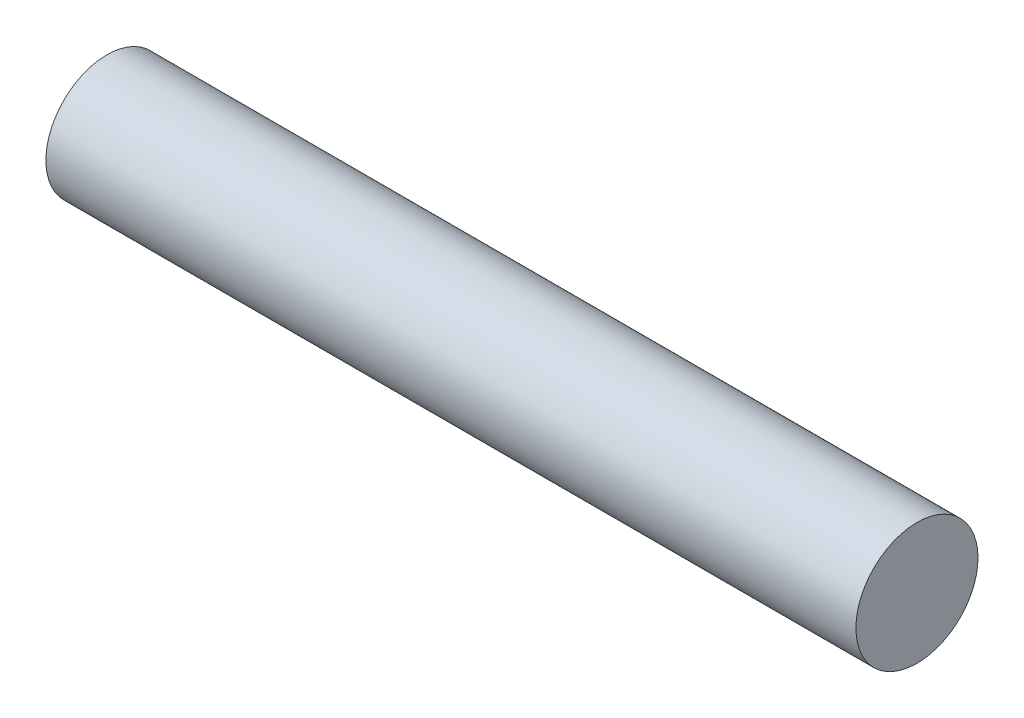
ISO-10303-21;
HEADER;
FILE_DESCRIPTION(('STEP AP214'),'2;1');
FILE_NAME('part.step','',(''),(''),'','','');
FILE_SCHEMA(('AUTOMOTIVE_DESIGN { 1 0 10303 214 1 1 1 1 }'));
ENDSEC;
DATA;
#1=APPLICATION_CONTEXT('core data for automotive mechanical design processes');
#2=APPLICATION_PROTOCOL_DEFINITION('international standard','automotive_design',2000,#1);
#3=PRODUCT_CONTEXT('',#1,'mechanical');
#4=PRODUCT('Part','Part','',(#3));
#5=PRODUCT_RELATED_PRODUCT_CATEGORY('part','',(#4));
#6=PRODUCT_DEFINITION_FORMATION('','',#4);
#7=PRODUCT_DEFINITION_CONTEXT('part definition',#1,'design');
#8=PRODUCT_DEFINITION('design','',#6,#7);
#9=PRODUCT_DEFINITION_SHAPE('','',#8);
#10=(LENGTH_UNIT() NAMED_UNIT(*) SI_UNIT(.MILLI.,.METRE.));
#11=(NAMED_UNIT(*) PLANE_ANGLE_UNIT() SI_UNIT($,.RADIAN.));
#12=(NAMED_UNIT(*) SI_UNIT($,.STERADIAN.) SOLID_ANGLE_UNIT());
#13=UNCERTAINTY_MEASURE_WITH_UNIT(LENGTH_MEASURE(1.E-05),#10,'distance_accuracy_value','');
#14=(GEOMETRIC_REPRESENTATION_CONTEXT(3) GLOBAL_UNCERTAINTY_ASSIGNED_CONTEXT((#13)) GLOBAL_UNIT_ASSIGNED_CONTEXT((#10,
#11,#12)) REPRESENTATION_CONTEXT('',''));
#15=CARTESIAN_POINT('',(0.,0.,0.));
#16=DIRECTION('',(0.,0.,1.));
#17=DIRECTION('',(1.,0.,0.));
#18=AXIS2_PLACEMENT_3D('',#15,#16,#17);
#19=CARTESIAN_POINT('',(92.9,0.,0.));
#20=DIRECTION('',(-1.,0.,0.));
#21=DIRECTION('',(0.,0.,1.));
#22=AXIS2_PLACEMENT_3D('',#19,#20,#21);
#23=CYLINDRICAL_SURFACE('',#22,7.);
#24=CARTESIAN_POINT('',(92.9,0.,0.));
#25=DIRECTION('',(1.,0.,0.));
#26=DIRECTION('',(0.,0.,-1.));
#27=AXIS2_PLACEMENT_3D('',#24,#25,#26);
#28=CIRCLE('',#27,7.);
#29=CARTESIAN_POINT('',(92.9,0.,-7.));
#30=VERTEX_POINT('',#29);
#31=EDGE_CURVE('E10',#30,#30,#28,.T.);
#32=ORIENTED_EDGE('',*,*,#31,.F.);
#33=EDGE_LOOP('',(#32));
#34=FACE_BOUND('',#33,.T.);
#35=CARTESIAN_POINT('',(0.,0.,0.));
#36=DIRECTION('',(1.,0.,0.));
#37=DIRECTION('',(0.,0.,-1.));
#38=AXIS2_PLACEMENT_3D('',#35,#36,#37);
#39=CIRCLE('',#38,7.);
#40=CARTESIAN_POINT('',(0.,0.,-7.));
#41=VERTEX_POINT('',#40);
#42=EDGE_CURVE('E40',#41,#41,#39,.T.);
#43=ORIENTED_EDGE('',*,*,#42,.T.);
#44=EDGE_LOOP('',(#43));
#45=FACE_BOUND('',#44,.T.);
#46=ADVANCED_FACE('F37',(#34,#45),#23,.T.);
#47=CARTESIAN_POINT('',(92.9,0.,0.));
#48=DIRECTION('',(1.,0.,0.));
#49=DIRECTION('',(0.,0.,-1.));
#50=AXIS2_PLACEMENT_3D('',#47,#48,#49);
#51=PLANE('',#50);
#52=ORIENTED_EDGE('',*,*,#31,.T.);
#53=EDGE_LOOP('',(#52));
#54=FACE_BOUND('',#53,.T.);
#55=ADVANCED_FACE('F54',(#54),#51,.T.);
#56=CARTESIAN_POINT('',(0.,0.,0.));
#57=DIRECTION('',(1.,0.,0.));
#58=DIRECTION('',(0.,0.,-1.));
#59=AXIS2_PLACEMENT_3D('',#56,#57,#58);
#60=PLANE('',#59);
#61=ORIENTED_EDGE('',*,*,#42,.F.);
#62=EDGE_LOOP('',(#61));
#63=FACE_BOUND('',#62,.T.);
#64=ADVANCED_FACE('F52',(#63),#60,.F.);
#65=CLOSED_SHELL('',(#46,#55,#64));
#66=MANIFOLD_SOLID_BREP('B2',#65);
#67=ADVANCED_BREP_SHAPE_REPRESENTATION('',(#18,#66),#14);
#68=SHAPE_DEFINITION_REPRESENTATION(#9,#67);
ENDSEC;
END-ISO-10303-21;
